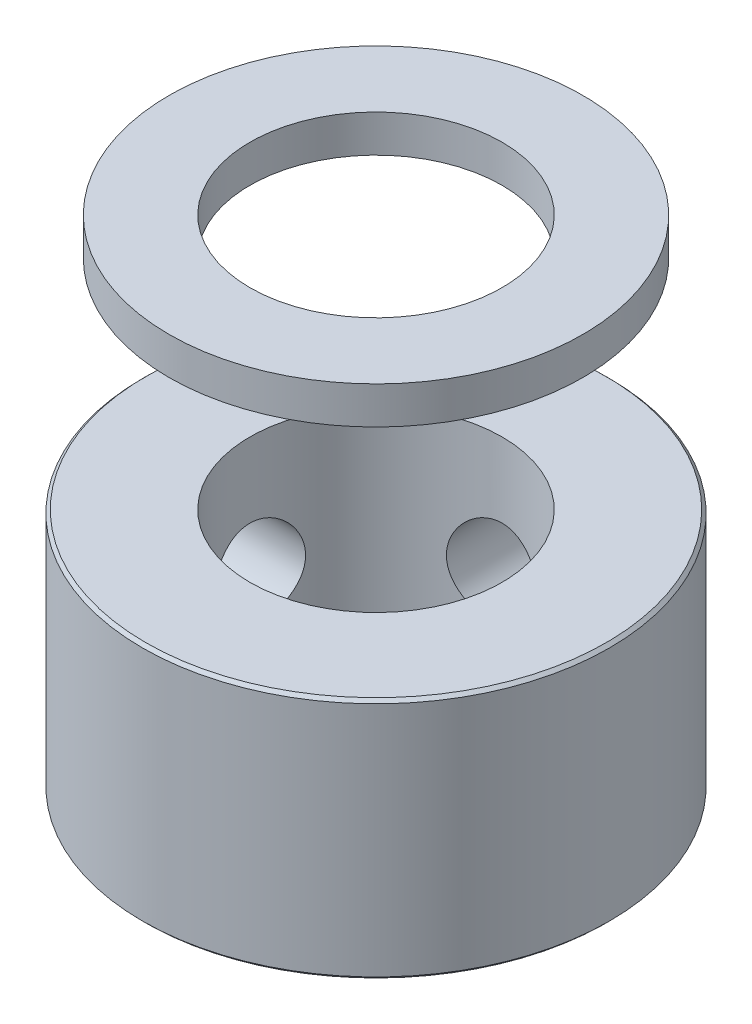
ISO-10303-21;
HEADER;
FILE_DESCRIPTION(('STEP AP214'),'2;1');
FILE_NAME('part.step','',(''),(''),'','','');
FILE_SCHEMA(('AUTOMOTIVE_DESIGN { 1 0 10303 214 1 1 1 1 }'));
ENDSEC;
DATA;
#1=APPLICATION_CONTEXT('core data for automotive mechanical design processes');
#2=APPLICATION_PROTOCOL_DEFINITION('international standard','automotive_design',2000,#1);
#3=PRODUCT_CONTEXT('',#1,'mechanical');
#4=PRODUCT('Part','Part','',(#3));
#5=PRODUCT_RELATED_PRODUCT_CATEGORY('part','',(#4));
#6=PRODUCT_DEFINITION_FORMATION('','',#4);
#7=PRODUCT_DEFINITION_CONTEXT('part definition',#1,'design');
#8=PRODUCT_DEFINITION('design','',#6,#7);
#9=PRODUCT_DEFINITION_SHAPE('','',#8);
#10=(LENGTH_UNIT() NAMED_UNIT(*) SI_UNIT(.MILLI.,.METRE.));
#11=(NAMED_UNIT(*) PLANE_ANGLE_UNIT() SI_UNIT($,.RADIAN.));
#12=(NAMED_UNIT(*) SI_UNIT($,.STERADIAN.) SOLID_ANGLE_UNIT());
#13=UNCERTAINTY_MEASURE_WITH_UNIT(LENGTH_MEASURE(1.E-05),#10,'distance_accuracy_value','');
#14=(GEOMETRIC_REPRESENTATION_CONTEXT(3) GLOBAL_UNCERTAINTY_ASSIGNED_CONTEXT((#13)) GLOBAL_UNIT_ASSIGNED_CONTEXT((#10,
#11,#12)) REPRESENTATION_CONTEXT('',''));
#15=CARTESIAN_POINT('',(0.,0.,0.));
#16=DIRECTION('',(0.,0.,1.));
#17=DIRECTION('',(1.,0.,0.));
#18=AXIS2_PLACEMENT_3D('',#15,#16,#17);
#19=CARTESIAN_POINT('',(0.,29.0132034355964,0.));
#20=DIRECTION('',(0.,-1.,0.));
#21=DIRECTION('',(0.,0.,-1.));
#22=AXIS2_PLACEMENT_3D('',#19,#20,#21);
#23=CYLINDRICAL_SURFACE('',#22,7.5);
#24=CARTESIAN_POINT('',(-7.34846922834953,3.9,1.5));
#25=CARTESIAN_POINT('',(-7.34847088538349,3.98334656323576,1.49999691881235));
#26=CARTESIAN_POINT('',(-7.34990262402618,4.06673193499975,1.49302975757707));
#27=CARTESIAN_POINT('',(-7.35546646957746,4.23114375771496,1.46536842537441));
#28=CARTESIAN_POINT('',(-7.35960073717297,4.31216826695404,1.44466327060578));
#29=CARTESIAN_POINT('',(-7.37008310582665,4.46945595503125,1.39019367392958));
#30=CARTESIAN_POINT('',(-7.37642900431582,4.54572378229886,1.35644222122892));
#31=CARTESIAN_POINT('',(-7.39061699221019,4.69151226704545,1.27687366150577));
#32=CARTESIAN_POINT('',(-7.398458998102,4.76103330080686,1.23105722790173));
#33=CARTESIAN_POINT('',(-7.4148794954137,4.89234150578079,1.12796861348015));
#34=CARTESIAN_POINT('',(-7.42346606755867,4.95401938182596,1.07055848386998));
#35=CARTESIAN_POINT('',(-7.440337084539,5.06693630036847,0.946210183531965));
#36=CARTESIAN_POINT('',(-7.44862150816248,5.11817461112579,0.879271345466975));
#37=CARTESIAN_POINT('',(-7.46404194626342,5.20918202644269,0.737042033886382));
#38=CARTESIAN_POINT('',(-7.47116732162326,5.24884727072496,0.661683851508315));
#39=CARTESIAN_POINT('',(-7.48337605325447,5.3149124055722,0.505206225580907));
#40=CARTESIAN_POINT('',(-7.48845960066179,5.34131353785148,0.424087322130829));
#41=CARTESIAN_POINT('',(-7.49595481032628,5.37976079042944,0.259525159917741));
#42=CARTESIAN_POINT('',(-7.4984007943219,5.39199146635651,0.176126608822221));
#43=CARTESIAN_POINT('',(-7.50046381775405,5.40232642775747,0.00842785265630406));
#44=CARTESIAN_POINT('',(-7.50008112979138,5.40043207446873,-0.0758722647477652));
#45=CARTESIAN_POINT('',(-7.49655652302773,5.38271072967667,-0.241713001115383));
#46=CARTESIAN_POINT('',(-7.49345397548757,5.36708253424823,-0.323275821447705));
#47=CARTESIAN_POINT('',(-7.48488265739113,5.32265245131166,-0.482597439870452));
#48=CARTESIAN_POINT('',(-7.47941379216059,5.29385003671219,-0.560356085620694));
#49=CARTESIAN_POINT('',(-7.46665944029938,5.2237049397791,-0.710429194801332));
#50=CARTESIAN_POINT('',(-7.45936272262835,5.18228437334267,-0.782706261200851));
#51=CARTESIAN_POINT('',(-7.44375704210678,5.0881363841451,-0.919357568789634));
#52=CARTESIAN_POINT('',(-7.43544796282833,5.03540766034422,-0.983730899287502));
#53=CARTESIAN_POINT('',(-7.41856446546689,4.91904956683729,-1.10392714658019));
#54=CARTESIAN_POINT('',(-7.40998794686274,4.85524621990561,-1.15958147486045));
#55=CARTESIAN_POINT('',(-7.39367357398141,4.71912533632387,-1.25942773976521));
#56=CARTESIAN_POINT('',(-7.38593573556822,4.64680763867521,-1.30361945959163));
#57=CARTESIAN_POINT('',(-7.37217071209385,4.49546875226729,-1.37934422220282));
#58=CARTESIAN_POINT('',(-7.36614722345324,4.41643354854051,-1.41084997166657));
#59=CARTESIAN_POINT('',(-7.35654714481909,4.25404301441401,-1.46008551244137));
#60=CARTESIAN_POINT('',(-7.35297023592642,4.17068824857137,-1.47781709918496));
#61=CARTESIAN_POINT('',(-7.34873218901742,4.00355271300143,-1.49874900905408));
#62=CARTESIAN_POINT('',(-7.34802220585731,3.91980363853449,-1.50219278834687));
#63=CARTESIAN_POINT('',(-7.34946728533281,3.75292766520047,-1.49510644246611));
#64=CARTESIAN_POINT('',(-7.35162218550582,3.6698007313217,-1.48457710968366));
#65=CARTESIAN_POINT('',(-7.35850848742372,3.50734703956164,-1.45005331211124));
#66=CARTESIAN_POINT('',(-7.36321498521745,3.42799148544635,-1.42618893125895));
#67=CARTESIAN_POINT('',(-7.37465234027497,3.27440508145689,-1.36581155296278));
#68=CARTESIAN_POINT('',(-7.38138336429404,3.20017465434642,-1.32929751355976));
#69=CARTESIAN_POINT('',(-7.39622108943059,3.05788033507476,-1.2441062133234));
#70=CARTESIAN_POINT('',(-7.40434457797355,2.98990943054876,-1.19527661697413));
#71=CARTESIAN_POINT('',(-7.42100585739955,2.86303753199862,-1.08704335831907));
#72=CARTESIAN_POINT('',(-7.42954369085727,2.80413747262612,-1.02763860771681));
#73=CARTESIAN_POINT('',(-7.44623018803823,2.69615616122163,-0.898848410246835));
#74=CARTESIAN_POINT('',(-7.45437086563026,2.647239518025,-0.829323748394444));
#75=CARTESIAN_POINT('',(-7.4692069144293,2.56178117775062,-0.682901844952132));
#76=CARTESIAN_POINT('',(-7.47590234632816,2.52523896098282,-0.606004913150259));
#77=CARTESIAN_POINT('',(-7.487059410916,2.46580669238005,-0.447454021236017));
#78=CARTESIAN_POINT('',(-7.49153368713906,2.44283922266062,-0.365830010217114));
#79=CARTESIAN_POINT('',(-7.4977985390649,2.41096312850423,-0.199784182019867));
#80=CARTESIAN_POINT('',(-7.49958943799765,2.40205281078647,-0.115362703066819));
#81=CARTESIAN_POINT('',(-7.50027810681181,2.39860952855567,0.0523093408554367));
#82=CARTESIAN_POINT('',(-7.49922567824026,2.40382907931568,0.135554718212255));
#83=CARTESIAN_POINT('',(-7.49445065340477,2.42795092582172,0.299956546973464));
#84=CARTESIAN_POINT('',(-7.49072809071528,2.44685304952211,0.381113024630538));
#85=CARTESIAN_POINT('',(-7.481032475475,2.49769348813747,0.538879124617646));
#86=CARTESIAN_POINT('',(-7.47506455871866,2.52960206719678,0.615498664860423));
#87=CARTESIAN_POINT('',(-7.46152083185077,2.60551836199635,0.762331830278931));
#88=CARTESIAN_POINT('',(-7.45394489468828,2.64952703385557,0.832544948651119));
#89=CARTESIAN_POINT('',(-7.43786398736791,2.74922908059312,0.965795835159537));
#90=CARTESIAN_POINT('',(-7.4293460013317,2.80509950458016,1.02869957417475));
#91=CARTESIAN_POINT('',(-7.41241834355477,2.92657536014365,1.14432392663527));
#92=CARTESIAN_POINT('',(-7.40400869794476,2.99218309420307,1.19704212480408));
#93=CARTESIAN_POINT('',(-7.3881501412478,3.13211897505031,1.29133832918279));
#94=CARTESIAN_POINT('',(-7.38071255446371,3.20653344174069,1.33279022195961));
#95=CARTESIAN_POINT('',(-7.36777855777287,3.3613991599494,1.40253607393175));
#96=CARTESIAN_POINT('',(-7.36228038807748,3.44184485804634,1.43084196896908));
#97=CARTESIAN_POINT('',(-7.3549452169166,3.58539368315525,1.4680037097813));
#98=CARTESIAN_POINT('',(-7.35253177367824,3.64767812926849,1.47998084778413));
#99=CARTESIAN_POINT('',(-7.34929317692711,3.77330093182915,1.49598002694097));
#100=CARTESIAN_POINT('',(-7.34846796865859,3.83663925186744,1.50000234234439));
#101=CARTESIAN_POINT('',(-7.34846922834953,3.9,1.5));
#102=B_SPLINE_CURVE_WITH_KNOTS('',3,(#24,#25,#26,#27,#28,#29,#30,#31,#32,#33,#34,#35,#36,#37,
#38,#39,#40,#41,#42,#43,#44,#45,#46,#47,#48,#49,#50,#51,#52,#53,#54,#55,#56,#57,#58,#59,#60,#61,
#62,#63,#64,#65,#66,#67,#68,#69,#70,#71,#72,#73,#74,#75,#76,#77,#78,#79,#80,#81,#82,#83,#84,#85,
#86,#87,#88,#89,#90,#91,#92,#93,#94,#95,#96,#97,#98,#99,#100,#101),.UNSPECIFIED.,.T.,.F.,(4,2,2,
2,2,2,2,2,2,2,2,2,2,2,2,2,2,2,2,2,2,2,2,2,2,2,2,2,2,2,2,2,2,2,2,2,2,2,4),(0.,0.249807695804143,
0.499815358926445,0.749574746910879,0.999320197289796,1.25223378822655,1.50516510053133,
1.76030100656175,2.0154130236984,2.26716373324621,2.51889018174372,2.76703184450306,
3.01518343610626,3.26489886333455,3.51464303655099,3.76874020143725,4.02284217184081,
4.27748794759165,4.53210052524037,4.7823563670689,5.03259801792632,5.28044012674978,
5.52830265531598,5.77939589661782,6.03051499305313,6.28548902600176,6.54045234945157,
6.79394720367975,7.04741152037442,7.29646526122029,7.54551587050135,7.79400025613178,
8.04250428202027,8.29501728038395,8.54759008334672,8.80288347868562,9.05794462633399,
9.24785705455344,9.43776293526322),.UNSPECIFIED.);
#103=CARTESIAN_POINT('',(-7.34846922834953,3.9,1.5));
#104=VERTEX_POINT('',#103);
#105=EDGE_CURVE('E89',#104,#104,#102,.T.);
#106=ORIENTED_EDGE('',*,*,#105,.F.);
#107=EDGE_LOOP('',(#106));
#108=FACE_BOUND('',#107,.T.);
#109=CARTESIAN_POINT('',(0.,5.4,-7.5));
#110=CARTESIAN_POINT('',(0.0833653601889499,5.39999693325248,-7.49999846371307));
#111=CARTESIAN_POINT('',(0.166769490302284,5.39302673554853,-7.49859577767346));
#112=CARTESIAN_POINT('',(0.331220261533529,5.36535224982713,-7.49313548434847));
#113=CARTESIAN_POINT('',(0.412264976312034,5.34463705079773,-7.48907576790279));
#114=CARTESIAN_POINT('',(0.569595457894969,5.29013808956882,-7.4787547391743));
#115=CARTESIAN_POINT('',(0.645885701899702,5.25636684473297,-7.47249553615077));
#116=CARTESIAN_POINT('',(0.791711983296339,5.17675162873306,-7.45845597052971));
#117=CARTESIAN_POINT('',(0.861248422613718,5.13090837658919,-7.4506756985356));
#118=CARTESIAN_POINT('',(0.992540215972298,5.02779225856285,-7.43433247994955));
#119=CARTESIAN_POINT('',(1.05419092673779,4.97038746691319,-7.42576118256521));
#120=CARTESIAN_POINT('',(1.16705513491204,4.84606137541245,-7.40886270678882));
#121=CARTESIAN_POINT('',(1.21826781715564,4.77913933299732,-7.40053554750636));
#122=CARTESIAN_POINT('',(1.30924763002143,4.63692571048219,-7.38498662718923));
#123=CARTESIAN_POINT('',(1.3489064082988,4.56156353430546,-7.37777561047419));
#124=CARTESIAN_POINT('',(1.41495849987046,4.40507727149388,-7.36539402087627));
#125=CARTESIAN_POINT('',(1.44135312365586,4.32395375498048,-7.36022324642942));
#126=CARTESIAN_POINT('',(1.47978794982724,4.15937345413812,-7.35259207878307));
#127=CARTESIAN_POINT('',(1.49201174693817,4.07596118378666,-7.35009705160781));
#128=CARTESIAN_POINT('',(1.50232819158918,3.90823526795349,-7.34799562590941));
#129=CARTESIAN_POINT('',(1.50042228407025,3.82392171551978,-7.34838893201761));
#130=CARTESIAN_POINT('',(1.48268185965273,3.65812981796849,-7.35198826722277));
#131=CARTESIAN_POINT('',(1.46705781036586,3.57662789155903,-7.35515179288145));
#132=CARTESIAN_POINT('',(1.42265682693458,3.4174258850055,-7.36386819240002));
#133=CARTESIAN_POINT('',(1.39387926465102,3.33972598662149,-7.36942118036668));
#134=CARTESIAN_POINT('',(1.32378717551208,3.1897271074446,-7.38233427750612));
#135=CARTESIAN_POINT('',(1.28238922684817,3.11746818064624,-7.38970634720557));
#136=CARTESIAN_POINT('',(1.18829036185902,2.98084372504078,-7.40541928159593));
#137=CARTESIAN_POINT('',(1.13558814653524,2.91647910472326,-7.41376025757549));
#138=CARTESIAN_POINT('',(1.01924990184088,2.79625589631459,-7.43065531862193));
#139=CARTESIAN_POINT('',(0.955434241818667,2.7405711482113,-7.43921053816357));
#140=CARTESIAN_POINT('',(0.819277536093014,2.64066923054816,-7.45543273071613));
#141=CARTESIAN_POINT('',(0.746936381069083,2.59645220805963,-7.4630996923346));
#142=CARTESIAN_POINT('',(0.595589080318381,2.52070873616104,-7.47670035241331));
#143=CARTESIAN_POINT('',(0.51657272937795,2.48920215953319,-7.48263133272408));
#144=CARTESIAN_POINT('',(0.354223464672997,2.43995928894215,-7.49207113481787));
#145=CARTESIAN_POINT('',(0.270891075108674,2.42222132688956,-7.49558025000797));
#146=CARTESIAN_POINT('',(0.103769108440726,2.40126531930858,-7.49974007800302));
#147=CARTESIAN_POINT('',(0.0200104924883643,2.3978093706896,-7.50043761978705));
#148=CARTESIAN_POINT('',(-0.146887401289071,2.40487478841327,-7.49902577895154));
#149=CARTESIAN_POINT('',(-0.23002671366569,2.41539536902889,-7.49691655412169));
#150=CARTESIAN_POINT('',(-0.392558489919811,2.44991756031593,-7.49015748012026));
#151=CARTESIAN_POINT('',(-0.471977922509855,2.47379710274685,-7.4855306460631));
#152=CARTESIAN_POINT('',(-0.625685441249501,2.53422597398371,-7.47425328091549));
#153=CARTESIAN_POINT('',(-0.699973142456309,2.57077625201524,-7.4676025982134));
#154=CARTESIAN_POINT('',(-0.842311760529326,2.65602373597697,-7.45289867299942));
#155=CARTESIAN_POINT('',(-0.910275190128282,2.70486417155842,-7.44482925655578));
#156=CARTESIAN_POINT('',(-1.03712702867881,2.81311378681092,-7.42822102244824));
#157=CARTESIAN_POINT('',(-1.09601446339614,2.8725240995998,-7.41968215452582));
#158=CARTESIAN_POINT('',(-1.20396088616126,3.00131002783668,-7.40293955335447));
#159=CARTESIAN_POINT('',(-1.25285655367298,3.070823616332,-7.39474290349956));
#160=CARTESIAN_POINT('',(-1.33827813007681,3.21721704203502,-7.37976287694291));
#161=CARTESIAN_POINT('',(-1.37480453388435,3.29409658436033,-7.37297944370014));
#162=CARTESIAN_POINT('',(-1.43422776237294,3.45265236922432,-7.36165110876574));
#163=CARTESIAN_POINT('',(-1.45719524968658,3.53430126181548,-7.3570946230828));
#164=CARTESIAN_POINT('',(-1.48906297744079,3.70040018023636,-7.35071155188038));
#165=CARTESIAN_POINT('',(-1.49796505233767,3.78484983931402,-7.34888461036667));
#166=CARTESIAN_POINT('',(-1.5013813663012,3.95251329681648,-7.34818724447069));
#167=CARTESIAN_POINT('',(-1.49615368210634,4.03572172339051,-7.34926378783951));
#168=CARTESIAN_POINT('',(-1.47202845615009,4.20004747485754,-7.35413360226921));
#169=CARTESIAN_POINT('',(-1.45313102419395,4.28116481654221,-7.35792685150754));
#170=CARTESIAN_POINT('',(-1.40231785274843,4.43884156686082,-7.36777896328738));
#171=CARTESIAN_POINT('',(-1.37043376007602,4.51541154075362,-7.37383231528246));
#172=CARTESIAN_POINT('',(-1.29458196690241,4.66215558110166,-7.38752572461255));
#173=CARTESIAN_POINT('',(-1.25061325316232,4.73232911058771,-7.39516591498341));
#174=CARTESIAN_POINT('',(-1.15095887217962,4.86557335822547,-7.41133440784838));
#175=CARTESIAN_POINT('',(-1.09508683085277,4.92850314790139,-7.41987559364549));
#176=CARTESIAN_POINT('',(-0.973596553519711,5.04417930829376,-7.43679122807932));
#177=CARTESIAN_POINT('',(-0.907976080730002,5.09692333547591,-7.44516563794777));
#178=CARTESIAN_POINT('',(-0.768026443632369,5.19125196591967,-7.46090748581957));
#179=CARTESIAN_POINT('',(-0.693613326644751,5.23271400492004,-7.46826346828869));
#180=CARTESIAN_POINT('',(-0.538749541411098,5.30247918389489,-7.481026876275));
#181=CARTESIAN_POINT('',(-0.458304391294689,5.33079418429874,-7.48643605707924));
#182=CARTESIAN_POINT('',(-0.314732233385669,5.36797792206707,-7.49364558893056));
#183=CARTESIAN_POINT('',(-0.252422496020677,5.37996479056164,-7.49601454737677));
#184=CARTESIAN_POINT('',(-0.1267492878151,5.39597686853755,-7.49919231209839));
#185=CARTESIAN_POINT('',(-0.0633858506229285,5.40000233176465,-7.50000116809732));
#186=CARTESIAN_POINT('',(0.,5.4,-7.5));
#187=B_SPLINE_CURVE_WITH_KNOTS('',3,(#109,#110,#111,#112,#113,#114,#115,#116,#117,#118,#119,
#120,#121,#122,#123,#124,#125,#126,#127,#128,#129,#130,#131,#132,#133,#134,#135,#136,#137,#138,
#139,#140,#141,#142,#143,#144,#145,#146,#147,#148,#149,#150,#151,#152,#153,#154,#155,#156,#157,
#158,#159,#160,#161,#162,#163,#164,#165,#166,#167,#168,#169,#170,#171,#172,#173,#174,#175,#176,
#177,#178,#179,#180,#181,#182,#183,#184,#185,#186),.UNSPECIFIED.,.T.,.F.,(4,2,2,2,2,2,2,2,2,2,2,
2,2,2,2,2,2,2,2,2,2,2,2,2,2,2,2,2,2,2,2,2,2,2,2,2,2,2,4),(0.,0.249864195991888,
0.499926976036985,0.749750602875513,0.999559353346295,1.25239900516828,1.50525839512105,
1.76041792508884,2.01555224047796,2.26734277655381,2.51910756421838,2.76707590509417,
3.01505608880595,3.26471235305389,3.51439732124506,3.76857378737026,4.0227535130973,
4.27732912281036,4.53187388547054,4.78216103514398,5.03243411486801,5.28045680926085,
5.52849808824034,5.77957599050038,6.03068082518895,6.28560942868839,6.540527830852,
6.79410571549085,7.04765052495622,7.29659583851552,7.54553915238913,7.79387941879665,
8.042240513728,8.29482114358714,8.54745981799396,8.80274245013456,9.05779433276278,
9.24778162934841,9.43776287056494),.UNSPECIFIED.);
#188=CARTESIAN_POINT('',(0.,5.4,-7.5));
#189=VERTEX_POINT('',#188);
#190=EDGE_CURVE('E81',#189,#189,#187,.T.);
#191=ORIENTED_EDGE('',*,*,#190,.F.);
#192=EDGE_LOOP('',(#191));
#193=FACE_BOUND('',#192,.T.);
#194=CARTESIAN_POINT('',(0.,0.0999999999999959,0.));
#195=DIRECTION('',(0.,-1.,0.));
#196=DIRECTION('',(0.,0.,-1.));
#197=AXIS2_PLACEMENT_3D('',#194,#195,#196);
#198=CIRCLE('',#197,7.5);
#199=CARTESIAN_POINT('',(0.,0.0999999999999959,-7.5));
#200=VERTEX_POINT('',#199);
#201=EDGE_CURVE('E69',#200,#200,#198,.F.);
#202=ORIENTED_EDGE('',*,*,#201,.T.);
#203=EDGE_LOOP('',(#202));
#204=FACE_BOUND('',#203,.T.);
#205=CARTESIAN_POINT('',(0.,7.7,0.));
#206=DIRECTION('',(0.,1.,0.));
#207=DIRECTION('',(0.,0.,1.));
#208=AXIS2_PLACEMENT_3D('',#205,#206,#207);
#209=CIRCLE('',#208,7.5);
#210=CARTESIAN_POINT('',(0.,7.7,7.5));
#211=VERTEX_POINT('',#210);
#212=EDGE_CURVE('E73',#211,#211,#209,.F.);
#213=ORIENTED_EDGE('',*,*,#212,.T.);
#214=EDGE_LOOP('',(#213));
#215=FACE_BOUND('',#214,.T.);
#216=ADVANCED_FACE('F56',(#108,#193,#204,#215),#23,.T.);
#217=CARTESIAN_POINT('',(0.,0.,0.));
#218=DIRECTION('',(0.,-1.,0.));
#219=DIRECTION('',(0.,0.,-1.));
#220=AXIS2_PLACEMENT_3D('',#217,#218,#219);
#221=PLANE('',#220);
#222=CARTESIAN_POINT('',(0.,0.,0.));
#223=DIRECTION('',(0.,-1.,0.));
#224=DIRECTION('',(0.,0.,-1.));
#225=AXIS2_PLACEMENT_3D('',#222,#223,#224);
#226=CIRCLE('',#225,4.05);
#227=CARTESIAN_POINT('',(0.,0.,-4.05));
#228=VERTEX_POINT('',#227);
#229=EDGE_CURVE('E113',#228,#228,#226,.T.);
#230=ORIENTED_EDGE('',*,*,#229,.F.);
#231=EDGE_LOOP('',(#230));
#232=FACE_BOUND('',#231,.T.);
#233=CARTESIAN_POINT('',(0.,0.,0.));
#234=DIRECTION('',(0.,-1.,0.));
#235=DIRECTION('',(0.,0.,-1.));
#236=AXIS2_PLACEMENT_3D('',#233,#234,#235);
#237=CIRCLE('',#236,7.4);
#238=CARTESIAN_POINT('',(0.,0.,-7.4));
#239=VERTEX_POINT('',#238);
#240=EDGE_CURVE('E78',#239,#239,#237,.T.);
#241=ORIENTED_EDGE('',*,*,#240,.T.);
#242=EDGE_LOOP('',(#241));
#243=FACE_BOUND('',#242,.T.);
#244=ADVANCED_FACE('F103',(#232,#243),#221,.T.);
#245=CARTESIAN_POINT('',(-5.82920154766281,7.8,-0.651228844027839));
#246=DIRECTION('',(0.,1.,0.));
#247=DIRECTION('',(0.,0.,1.));
#248=AXIS2_PLACEMENT_3D('',#245,#246,#247);
#249=PLANE('',#248);
#250=CARTESIAN_POINT('',(0.,7.8,0.));
#251=DIRECTION('',(0.,1.,0.));
#252=DIRECTION('',(0.,0.,1.));
#253=AXIS2_PLACEMENT_3D('',#250,#251,#252);
#254=CIRCLE('',#253,4.05);
#255=CARTESIAN_POINT('',(0.,7.8,4.05));
#256=VERTEX_POINT('',#255);
#257=EDGE_CURVE('E112',#256,#256,#254,.T.);
#258=ORIENTED_EDGE('',*,*,#257,.F.);
#259=EDGE_LOOP('',(#258));
#260=FACE_BOUND('',#259,.T.);
#261=CARTESIAN_POINT('',(0.,7.8,0.));
#262=DIRECTION('',(0.,1.,0.));
#263=DIRECTION('',(0.,0.,1.));
#264=AXIS2_PLACEMENT_3D('',#261,#262,#263);
#265=CIRCLE('',#264,7.4);
#266=CARTESIAN_POINT('',(0.,7.8,7.4));
#267=VERTEX_POINT('',#266);
#268=EDGE_CURVE('E13',#267,#267,#265,.T.);
#269=ORIENTED_EDGE('',*,*,#268,.T.);
#270=EDGE_LOOP('',(#269));
#271=FACE_BOUND('',#270,.T.);
#272=ADVANCED_FACE('F130',(#260,#271),#249,.T.);
#273=CARTESIAN_POINT('',(0.,0.,0.));
#274=DIRECTION('',(0.,1.,0.));
#275=DIRECTION('',(0.,0.,1.));
#276=AXIS2_PLACEMENT_3D('',#273,#274,#275);
#277=CONICAL_SURFACE('',#276,7.4,0.785398163397444);
#278=ORIENTED_EDGE('',*,*,#201,.F.);
#279=EDGE_LOOP('',(#278));
#280=FACE_BOUND('',#279,.T.);
#281=ORIENTED_EDGE('',*,*,#240,.F.);
#282=EDGE_LOOP('',(#281));
#283=FACE_BOUND('',#282,.T.);
#284=ADVANCED_FACE('F142',(#280,#283),#277,.T.);
#285=CARTESIAN_POINT('',(0.,7.7,0.));
#286=DIRECTION('',(0.,-1.,0.));
#287=DIRECTION('',(0.,0.,-1.));
#288=AXIS2_PLACEMENT_3D('',#285,#286,#287);
#289=CONICAL_SURFACE('',#288,7.5,0.78539816339747);
#290=ORIENTED_EDGE('',*,*,#268,.F.);
#291=EDGE_LOOP('',(#290));
#292=FACE_BOUND('',#291,.T.);
#293=ORIENTED_EDGE('',*,*,#212,.F.);
#294=EDGE_LOOP('',(#293));
#295=FACE_BOUND('',#294,.T.);
#296=ADVANCED_FACE('F58',(#292,#295),#289,.T.);
#297=CARTESIAN_POINT('',(0.,3.9,-2.5));
#298=DIRECTION('',(0.,0.,-1.));
#299=DIRECTION('',(-1.,0.,0.));
#300=AXIS2_PLACEMENT_3D('',#297,#298,#299);
#301=CYLINDRICAL_SURFACE('',#300,1.5);
#302=CARTESIAN_POINT('',(-1.5,3.9,-3.76198086119534));
#303=CARTESIAN_POINT('',(-1.50000268526301,3.81891086653167,-3.76197839280445));
#304=CARTESIAN_POINT('',(-1.49340264076728,3.73783969095228,-3.76463115394949));
#305=CARTESIAN_POINT('',(-1.46729342623131,3.57813675696255,-3.77488334160202));
#306=CARTESIAN_POINT('',(-1.44778438739025,3.49950497376821,-3.78248271783512));
#307=CARTESIAN_POINT('',(-1.39666712891509,3.34702998485343,-3.80165174920774));
#308=CARTESIAN_POINT('',(-1.36508726383579,3.27317602775594,-3.81321209342976));
#309=CARTESIAN_POINT('',(-1.2908248804427,3.13178609309349,-3.83898567457824));
#310=CARTESIAN_POINT('',(-1.24813911665265,3.06425197023043,-3.85319968664243));
#311=CARTESIAN_POINT('',(-1.15066109488168,2.93414602378057,-3.88345087211371));
#312=CARTESIAN_POINT('',(-1.09541831087432,2.87192391460834,-3.89954077914951));
#313=CARTESIAN_POINT('',(-0.975350935608381,2.75738155863417,-3.93129025761673));
#314=CARTESIAN_POINT('',(-0.910524369137047,2.70506335810389,-3.94694973954686));
#315=CARTESIAN_POINT('',(-0.770486414268711,2.61014086287826,-3.97669889097027));
#316=CARTESIAN_POINT('',(-0.695002454882204,2.56791511186464,-3.99071950369741));
#317=CARTESIAN_POINT('',(-0.53739163469184,2.49690576921902,-4.01497876804958));
#318=CARTESIAN_POINT('',(-0.45526702795573,2.46811763867368,-4.02521869645653));
#319=CARTESIAN_POINT('',(-0.290381657868036,2.42602250863372,-4.04038858558274));
#320=CARTESIAN_POINT('',(-0.207793810305046,2.41211378439031,-4.04552428501195));
#321=CARTESIAN_POINT('',(-0.0413072394312783,2.39824599139475,-4.05064448004876));
#322=CARTESIAN_POINT('',(0.0425910595962084,2.39828249753571,-4.05063060972022));
#323=CARTESIAN_POINT('',(0.205010295749702,2.41195006131238,-4.0455850984626));
#324=CARTESIAN_POINT('',(0.283595294198198,2.42492471753857,-4.04079573726147));
#325=CARTESIAN_POINT('',(0.437381552327644,2.46299829394546,-4.02705356647878));
#326=CARTESIAN_POINT('',(0.512582572712142,2.48809807008024,-4.01810046296595));
#327=CARTESIAN_POINT('',(0.658752801329339,2.55002307690829,-3.99675915596456));
#328=CARTESIAN_POINT('',(0.729645307556595,2.58701224210416,-3.98432325904462));
#329=CARTESIAN_POINT('',(0.864391370654589,2.67152222174946,-3.95727903982467));
#330=CARTESIAN_POINT('',(0.928242678334625,2.7190463869161,-3.94267002684004));
#331=CARTESIAN_POINT('',(1.05096585592654,2.8264572117511,-3.91180298180388));
#332=CARTESIAN_POINT('',(1.10934390094551,2.88689556525953,-3.8954984243782));
#333=CARTESIAN_POINT('',(1.21531903186268,3.01680745123776,-3.86375039575867));
#334=CARTESIAN_POINT('',(1.26291354531248,3.08628313338422,-3.84830713069002));
#335=CARTESIAN_POINT('',(1.34688236495765,3.2342006228061,-3.81974128332706));
#336=CARTESIAN_POINT('',(1.38299759688043,3.31280120263355,-3.80667479874832));
#337=CARTESIAN_POINT('',(1.44129459222816,3.47557948136236,-3.78498994926376));
#338=CARTESIAN_POINT('',(1.46348388054182,3.55975414107555,-3.77636918256249));
#339=CARTESIAN_POINT('',(1.49218967151314,3.72642115899883,-3.7651157106558));
#340=CARTESIAN_POINT('',(1.49948858623343,3.80875846945688,-3.7621844890466));
#341=CARTESIAN_POINT('',(1.50045904541502,3.97351558405182,-3.76179811369397));
#342=CARTESIAN_POINT('',(1.49413387646042,4.05593536350027,-3.76434163925854));
#343=CARTESIAN_POINT('',(1.46874447698623,4.21455961016314,-3.77431560937444));
#344=CARTESIAN_POINT('',(1.45027764868389,4.29087578277982,-3.78151663420189));
#345=CARTESIAN_POINT('',(1.40187668611806,4.43929390696458,-3.79972440246217));
#346=CARTESIAN_POINT('',(1.37194023753252,4.51139500463505,-3.81073191391822));
#347=CARTESIAN_POINT('',(1.3002061083661,4.65229198213217,-3.83581210076335));
#348=CARTESIAN_POINT('',(1.25801174060833,4.72086793180903,-3.84998283895795));
#349=CARTESIAN_POINT('',(1.16338463506486,4.85024459848432,-3.87962514523604));
#350=CARTESIAN_POINT('',(1.11094823035484,4.9110425177984,-3.89509717808496));
#351=CARTESIAN_POINT('',(0.993504126214828,5.02701834020833,-3.92674995855116));
#352=CARTESIAN_POINT('',(0.927921237045249,5.08161983983996,-3.94291569826283));
#353=CARTESIAN_POINT('',(0.788126344879295,5.17910783640429,-3.97321850327075));
#354=CARTESIAN_POINT('',(0.713914363104408,5.2219943621467,-3.98735557355591));
#355=CARTESIAN_POINT('',(0.559061204061839,5.29453528925228,-4.01199023462045));
#356=CARTESIAN_POINT('',(0.478446519637073,5.32424117740281,-4.02250195040793));
#357=CARTESIAN_POINT('',(0.31288762217606,5.36950903351663,-4.03875045169103));
#358=CARTESIAN_POINT('',(0.227945406398301,5.38507746490672,-4.04448941911234));
#359=CARTESIAN_POINT('',(0.0613592363511148,5.40094439553546,-4.05034387403351));
#360=CARTESIAN_POINT('',(-0.020196734863075,5.40206271323805,-4.05076125919962));
#361=CARTESIAN_POINT('',(-0.182283854179243,5.3910964224398,-4.04670758061015));
#362=CARTESIAN_POINT('',(-0.262815119710378,5.37901334083151,-4.04223708219408));
#363=CARTESIAN_POINT('',(-0.418662569759399,5.34256012810747,-4.02904479703217));
#364=CARTESIAN_POINT('',(-0.494056586231361,5.31848319870074,-4.02042461503456));
#365=CARTESIAN_POINT('',(-0.639743886165475,5.25901504434104,-3.99983077313999));
#366=CARTESIAN_POINT('',(-0.710036202324679,5.22362168058717,-3.9878564793705));
#367=CARTESIAN_POINT('',(-0.846722267802311,5.14084974508666,-3.96113788233216));
#368=CARTESIAN_POINT('',(-0.912832653753186,5.09303426784743,-3.94629915304809));
#369=CARTESIAN_POINT('',(-1.0363464513832,4.9874702419681,-3.91567902176774));
#370=CARTESIAN_POINT('',(-1.09374677360271,4.92971818424989,-3.89989728804132));
#371=CARTESIAN_POINT('',(-1.2012302147107,4.80240437394685,-3.86818412587118));
#372=CARTESIAN_POINT('',(-1.25078861265519,4.73238953348598,-3.85228636044178));
#373=CARTESIAN_POINT('',(-1.33744992968852,4.58452221339597,-3.82306517871813));
#374=CARTESIAN_POINT('',(-1.37455213911701,4.50666928753978,-3.80974190911773));
#375=CARTESIAN_POINT('',(-1.43601670526684,4.34247825652102,-3.78701428709424));
#376=CARTESIAN_POINT('',(-1.4599134543382,4.25594387570858,-3.77775528078647));
#377=CARTESIAN_POINT('',(-1.49189875430892,4.07959762401924,-3.76524178067321));
#378=CARTESIAN_POINT('',(-1.49999702668092,3.98978780334453,-3.76198359437777));
#379=CARTESIAN_POINT('',(-1.5,3.9,-3.76198086119534));
#380=B_SPLINE_CURVE_WITH_KNOTS('',3,(#302,#303,#304,#305,#306,#307,#308,#309,#310,#311,#312,
#313,#314,#315,#316,#317,#318,#319,#320,#321,#322,#323,#324,#325,#326,#327,#328,#329,#330,#331,
#332,#333,#334,#335,#336,#337,#338,#339,#340,#341,#342,#343,#344,#345,#346,#347,#348,#349,#350,
#351,#352,#353,#354,#355,#356,#357,#358,#359,#360,#361,#362,#363,#364,#365,#366,#367,#368,#369,
#370,#371,#372,#373,#374,#375,#376,#377,#378,#379),.UNSPECIFIED.,.T.,.F.,(4,2,2,2,2,2,2,2,2,2,2,
2,2,2,2,2,2,2,2,2,2,2,2,2,2,2,2,2,2,2,2,2,2,2,2,2,2,2,4),(0.,0.242933264780759,
0.485864060573542,0.728227680714842,0.97066220647273,1.22377778926956,1.47694561197519,
1.73848739194063,1.99994076517857,2.25036705443976,2.50071387838223,2.7389744847736,
2.97725191326209,3.21896687480589,3.46075882576671,3.71638304363279,3.97206817747706,
4.23317026287089,4.49413113990897,4.74098468620362,4.98777868984588,5.22325683021158,
5.45878251003316,5.70299346281828,5.94729201048285,6.20663019986449,6.4659677514704,
6.72428315168351,6.98248039454193,7.22596012354543,7.46941169431967,7.70718414319922,
7.94500155755302,8.19270089795977,8.44048789297793,8.70095423176161,8.9614354074497,
9.23059451546758,9.49958794616565),.UNSPECIFIED.);
#381=CARTESIAN_POINT('',(-1.5,3.9,-3.76198086119534));
#382=VERTEX_POINT('',#381);
#383=EDGE_CURVE('E106',#382,#382,#380,.T.);
#384=ORIENTED_EDGE('',*,*,#383,.T.);
#385=EDGE_LOOP('',(#384));
#386=FACE_BOUND('',#385,.T.);
#387=ORIENTED_EDGE('',*,*,#190,.T.);
#388=EDGE_LOOP('',(#387));
#389=FACE_BOUND('',#388,.T.);
#390=ADVANCED_FACE('F97',(#386,#389),#301,.F.);
#391=CARTESIAN_POINT('',(-2.5,3.9,0.));
#392=DIRECTION('',(-1.,0.,0.));
#393=DIRECTION('',(0.,0.,1.));
#394=AXIS2_PLACEMENT_3D('',#391,#392,#393);
#395=CYLINDRICAL_SURFACE('',#394,1.5);
#396=CARTESIAN_POINT('',(-3.76198086119534,3.9,1.5));
#397=CARTESIAN_POINT('',(-3.76197839280445,3.81891086653167,1.50000268526301));
#398=CARTESIAN_POINT('',(-3.76463115394949,3.73783969095228,1.49340264076728));
#399=CARTESIAN_POINT('',(-3.77488334160202,3.57813675696255,1.46729342623131));
#400=CARTESIAN_POINT('',(-3.78248271783512,3.49950497376821,1.44778438739025));
#401=CARTESIAN_POINT('',(-3.80165174920774,3.34702998485343,1.39666712891509));
#402=CARTESIAN_POINT('',(-3.81321209342976,3.27317602775594,1.36508726383579));
#403=CARTESIAN_POINT('',(-3.83898567457824,3.13178609309349,1.2908248804427));
#404=CARTESIAN_POINT('',(-3.85319968664243,3.06425197023043,1.24813911665265));
#405=CARTESIAN_POINT('',(-3.88345087211371,2.93414602378057,1.15066109488168));
#406=CARTESIAN_POINT('',(-3.89954077914951,2.87192391460834,1.09541831087432));
#407=CARTESIAN_POINT('',(-3.93129025761673,2.75738155863417,0.975350935608381));
#408=CARTESIAN_POINT('',(-3.94694973954686,2.70506335810389,0.910524369137047));
#409=CARTESIAN_POINT('',(-3.97669889097027,2.61014086287826,0.770486414268711));
#410=CARTESIAN_POINT('',(-3.99071950369741,2.56791511186464,0.695002454882204));
#411=CARTESIAN_POINT('',(-4.01497876804958,2.49690576921902,0.53739163469184));
#412=CARTESIAN_POINT('',(-4.02521869645653,2.46811763867368,0.45526702795573));
#413=CARTESIAN_POINT('',(-4.04038858558274,2.42602250863372,0.290381657868036));
#414=CARTESIAN_POINT('',(-4.04552428501195,2.41211378439031,0.207793810305046));
#415=CARTESIAN_POINT('',(-4.05064448004876,2.39824599139475,0.0413072394312782));
#416=CARTESIAN_POINT('',(-4.05063060972022,2.39828249753571,-0.0425910595962086));
#417=CARTESIAN_POINT('',(-4.0455850984626,2.41195006131238,-0.205010295749702));
#418=CARTESIAN_POINT('',(-4.04079573726147,2.42492471753857,-0.283595294198198));
#419=CARTESIAN_POINT('',(-4.02705356647878,2.46299829394546,-0.437381552327644));
#420=CARTESIAN_POINT('',(-4.01810046296595,2.48809807008024,-0.512582572712142));
#421=CARTESIAN_POINT('',(-3.99675915596456,2.55002307690829,-0.658752801329339));
#422=CARTESIAN_POINT('',(-3.98432325904462,2.58701224210416,-0.729645307556595));
#423=CARTESIAN_POINT('',(-3.95727903982467,2.67152222174946,-0.864391370654589));
#424=CARTESIAN_POINT('',(-3.94267002684004,2.7190463869161,-0.928242678334625));
#425=CARTESIAN_POINT('',(-3.91180298180388,2.8264572117511,-1.05096585592654));
#426=CARTESIAN_POINT('',(-3.8954984243782,2.88689556525953,-1.10934390094551));
#427=CARTESIAN_POINT('',(-3.86375039575867,3.01680745123776,-1.21531903186268));
#428=CARTESIAN_POINT('',(-3.84830713069002,3.08628313338422,-1.26291354531248));
#429=CARTESIAN_POINT('',(-3.81974128332706,3.2342006228061,-1.34688236495765));
#430=CARTESIAN_POINT('',(-3.80667479874832,3.31280120263355,-1.38299759688043));
#431=CARTESIAN_POINT('',(-3.78498994926376,3.47557948136236,-1.44129459222816));
#432=CARTESIAN_POINT('',(-3.77636918256249,3.55975414107555,-1.46348388054182));
#433=CARTESIAN_POINT('',(-3.7651157106558,3.72642115899883,-1.49218967151314));
#434=CARTESIAN_POINT('',(-3.7621844890466,3.80875846945688,-1.49948858623343));
#435=CARTESIAN_POINT('',(-3.76179811369397,3.97351558405182,-1.50045904541502));
#436=CARTESIAN_POINT('',(-3.76434163925854,4.05593536350027,-1.49413387646042));
#437=CARTESIAN_POINT('',(-3.77431560937444,4.21455961016314,-1.46874447698623));
#438=CARTESIAN_POINT('',(-3.78151663420189,4.29087578277982,-1.45027764868389));
#439=CARTESIAN_POINT('',(-3.79972440246217,4.43929390696458,-1.40187668611806));
#440=CARTESIAN_POINT('',(-3.81073191391822,4.51139500463505,-1.37194023753252));
#441=CARTESIAN_POINT('',(-3.83581210076335,4.65229198213217,-1.3002061083661));
#442=CARTESIAN_POINT('',(-3.84998283895795,4.72086793180903,-1.25801174060833));
#443=CARTESIAN_POINT('',(-3.87962514523604,4.85024459848432,-1.16338463506486));
#444=CARTESIAN_POINT('',(-3.89509717808496,4.9110425177984,-1.11094823035484));
#445=CARTESIAN_POINT('',(-3.92674995855116,5.02701834020833,-0.993504126214828));
#446=CARTESIAN_POINT('',(-3.94291569826283,5.08161983983996,-0.927921237045249));
#447=CARTESIAN_POINT('',(-3.97321850327075,5.17910783640429,-0.788126344879295));
#448=CARTESIAN_POINT('',(-3.98735557355591,5.2219943621467,-0.713914363104409));
#449=CARTESIAN_POINT('',(-4.01199023462045,5.29453528925228,-0.559061204061839));
#450=CARTESIAN_POINT('',(-4.02250195040793,5.32424117740281,-0.478446519637073));
#451=CARTESIAN_POINT('',(-4.03875045169103,5.36950903351663,-0.31288762217606));
#452=CARTESIAN_POINT('',(-4.04448941911234,5.38507746490672,-0.227945406398301));
#453=CARTESIAN_POINT('',(-4.05034387403351,5.40094439553546,-0.0613592363511149));
#454=CARTESIAN_POINT('',(-4.05076125919962,5.40206271323805,0.0201967348630749));
#455=CARTESIAN_POINT('',(-4.04670758061015,5.3910964224398,0.182283854179243));
#456=CARTESIAN_POINT('',(-4.04223708219408,5.37901334083151,0.262815119710378));
#457=CARTESIAN_POINT('',(-4.02904479703217,5.34256012810747,0.418662569759398));
#458=CARTESIAN_POINT('',(-4.02042461503456,5.31848319870074,0.494056586231361));
#459=CARTESIAN_POINT('',(-3.99983077313999,5.25901504434104,0.639743886165475));
#460=CARTESIAN_POINT('',(-3.9878564793705,5.22362168058717,0.710036202324678));
#461=CARTESIAN_POINT('',(-3.96113788233216,5.14084974508666,0.846722267802311));
#462=CARTESIAN_POINT('',(-3.94629915304809,5.09303426784743,0.912832653753186));
#463=CARTESIAN_POINT('',(-3.91567902176774,4.9874702419681,1.0363464513832));
#464=CARTESIAN_POINT('',(-3.89989728804132,4.92971818424989,1.09374677360271));
#465=CARTESIAN_POINT('',(-3.86818412587118,4.80240437394685,1.2012302147107));
#466=CARTESIAN_POINT('',(-3.85228636044178,4.73238953348598,1.25078861265519));
#467=CARTESIAN_POINT('',(-3.82306517871813,4.58452221339597,1.33744992968852));
#468=CARTESIAN_POINT('',(-3.80974190911773,4.50666928753978,1.37455213911701));
#469=CARTESIAN_POINT('',(-3.78701428709424,4.34247825652102,1.43601670526684));
#470=CARTESIAN_POINT('',(-3.77775528078647,4.25594387570858,1.4599134543382));
#471=CARTESIAN_POINT('',(-3.76524178067321,4.07959762401924,1.49189875430892));
#472=CARTESIAN_POINT('',(-3.76198359437777,3.98978780334453,1.49999702668092));
#473=CARTESIAN_POINT('',(-3.76198086119534,3.9,1.5));
#474=B_SPLINE_CURVE_WITH_KNOTS('',3,(#396,#397,#398,#399,#400,#401,#402,#403,#404,#405,#406,
#407,#408,#409,#410,#411,#412,#413,#414,#415,#416,#417,#418,#419,#420,#421,#422,#423,#424,#425,
#426,#427,#428,#429,#430,#431,#432,#433,#434,#435,#436,#437,#438,#439,#440,#441,#442,#443,#444,
#445,#446,#447,#448,#449,#450,#451,#452,#453,#454,#455,#456,#457,#458,#459,#460,#461,#462,#463,
#464,#465,#466,#467,#468,#469,#470,#471,#472,#473),.UNSPECIFIED.,.T.,.F.,(4,2,2,2,2,2,2,2,2,2,2,
2,2,2,2,2,2,2,2,2,2,2,2,2,2,2,2,2,2,2,2,2,2,2,2,2,2,2,4),(0.,0.242933264780759,
0.485864060573542,0.728227680714842,0.97066220647273,1.22377778926956,1.47694561197519,
1.73848739194063,1.99994076517857,2.25036705443976,2.50071387838223,2.7389744847736,
2.97725191326209,3.21896687480589,3.46075882576672,3.71638304363279,3.97206817747706,
4.2331702628709,4.49413113990897,4.74098468620362,4.98777868984589,5.22325683021158,
5.45878251003316,5.70299346281828,5.94729201048285,6.20663019986449,6.4659677514704,
6.72428315168351,6.98248039454193,7.22596012354543,7.46941169431967,7.70718414319922,
7.94500155755302,8.19270089795977,8.44048789297793,8.70095423176161,8.9614354074497,
9.23059451546759,9.49958794616566),.UNSPECIFIED.);
#475=CARTESIAN_POINT('',(-3.76198086119534,3.9,1.5));
#476=VERTEX_POINT('',#475);
#477=EDGE_CURVE('E60',#476,#476,#474,.T.);
#478=ORIENTED_EDGE('',*,*,#477,.T.);
#479=EDGE_LOOP('',(#478));
#480=FACE_BOUND('',#479,.T.);
#481=ORIENTED_EDGE('',*,*,#105,.T.);
#482=EDGE_LOOP('',(#481));
#483=FACE_BOUND('',#482,.T.);
#484=ADVANCED_FACE('F100',(#480,#483),#395,.F.);
#485=CARTESIAN_POINT('',(0.,20.,0.));
#486=DIRECTION('',(0.,-1.,0.));
#487=DIRECTION('',(0.,0.,-1.));
#488=AXIS2_PLACEMENT_3D('',#485,#486,#487);
#489=CYLINDRICAL_SURFACE('',#488,4.05);
#490=ORIENTED_EDGE('',*,*,#257,.T.);
#491=EDGE_LOOP('',(#490));
#492=FACE_BOUND('',#491,.T.);
#493=ORIENTED_EDGE('',*,*,#477,.F.);
#494=EDGE_LOOP('',(#493));
#495=FACE_BOUND('',#494,.T.);
#496=ORIENTED_EDGE('',*,*,#229,.T.);
#497=EDGE_LOOP('',(#496));
#498=FACE_BOUND('',#497,.T.);
#499=ORIENTED_EDGE('',*,*,#383,.F.);
#500=EDGE_LOOP('',(#499));
#501=FACE_BOUND('',#500,.T.);
#502=ADVANCED_FACE('F114',(#492,#495,#498,#501),#489,.F.);
#503=CLOSED_SHELL('',(#216,#244,#272,#284,#296,#390,#484,#502));
#504=MANIFOLD_SOLID_BREP('B2',#503);
#505=CARTESIAN_POINT('',(0.,16.,0.));
#506=DIRECTION('',(0.,1.,0.));
#507=DIRECTION('',(0.,0.,1.));
#508=AXIS2_PLACEMENT_3D('',#505,#506,#507);
#509=PLANE('',#508);
#510=CARTESIAN_POINT('',(0.,16.,0.));
#511=DIRECTION('',(0.,1.,0.));
#512=DIRECTION('',(0.,0.,1.));
#513=AXIS2_PLACEMENT_3D('',#510,#511,#512);
#514=CIRCLE('',#513,4.05);
#515=CARTESIAN_POINT('',(0.,16.,4.05));
#516=VERTEX_POINT('',#515);
#517=EDGE_CURVE('E220',#516,#516,#514,.T.);
#518=ORIENTED_EDGE('',*,*,#517,.F.);
#519=EDGE_LOOP('',(#518));
#520=FACE_BOUND('',#519,.T.);
#521=CARTESIAN_POINT('',(0.,16.,0.));
#522=DIRECTION('',(0.,1.,0.));
#523=DIRECTION('',(0.,0.,1.));
#524=AXIS2_PLACEMENT_3D('',#521,#522,#523);
#525=CIRCLE('',#524,6.65);
#526=CARTESIAN_POINT('',(0.,16.,6.65));
#527=VERTEX_POINT('',#526);
#528=EDGE_CURVE('E216',#527,#527,#525,.T.);
#529=ORIENTED_EDGE('',*,*,#528,.T.);
#530=EDGE_LOOP('',(#529));
#531=FACE_BOUND('',#530,.T.);
#532=ADVANCED_FACE('F209',(#520,#531),#509,.T.);
#533=CARTESIAN_POINT('',(-5.82920154766281,14.8,-0.651228844027839));
#534=DIRECTION('',(0.,1.,0.));
#535=DIRECTION('',(0.,0.,1.));
#536=AXIS2_PLACEMENT_3D('',#533,#534,#535);
#537=PLANE('',#536);
#538=CARTESIAN_POINT('',(0.,14.8,0.));
#539=DIRECTION('',(0.,1.,0.));
#540=DIRECTION('',(0.,0.,1.));
#541=AXIS2_PLACEMENT_3D('',#538,#539,#540);
#542=CIRCLE('',#541,4.05);
#543=CARTESIAN_POINT('',(0.,14.8,4.05));
#544=VERTEX_POINT('',#543);
#545=EDGE_CURVE('E212',#544,#544,#542,.T.);
#546=ORIENTED_EDGE('',*,*,#545,.T.);
#547=EDGE_LOOP('',(#546));
#548=FACE_BOUND('',#547,.T.);
#549=CARTESIAN_POINT('',(0.,14.8,0.));
#550=DIRECTION('',(0.,1.,0.));
#551=DIRECTION('',(0.,0.,1.));
#552=AXIS2_PLACEMENT_3D('',#549,#550,#551);
#553=CIRCLE('',#552,6.65);
#554=CARTESIAN_POINT('',(0.,14.8,6.65));
#555=VERTEX_POINT('',#554);
#556=EDGE_CURVE('E55',#555,#555,#553,.T.);
#557=ORIENTED_EDGE('',*,*,#556,.F.);
#558=EDGE_LOOP('',(#557));
#559=FACE_BOUND('',#558,.T.);
#560=ADVANCED_FACE('F229',(#548,#559),#537,.F.);
#561=CARTESIAN_POINT('',(0.,11.,0.));
#562=DIRECTION('',(0.,1.,0.));
#563=DIRECTION('',(0.,0.,1.));
#564=AXIS2_PLACEMENT_3D('',#561,#562,#563);
#565=CYLINDRICAL_SURFACE('',#564,6.65);
#566=ORIENTED_EDGE('',*,*,#528,.F.);
#567=EDGE_LOOP('',(#566));
#568=FACE_BOUND('',#567,.T.);
#569=ORIENTED_EDGE('',*,*,#556,.T.);
#570=EDGE_LOOP('',(#569));
#571=FACE_BOUND('',#570,.T.);
#572=ADVANCED_FACE('F234',(#568,#571),#565,.T.);
#573=CARTESIAN_POINT('',(0.,20.,0.));
#574=DIRECTION('',(0.,-1.,0.));
#575=DIRECTION('',(0.,0.,-1.));
#576=AXIS2_PLACEMENT_3D('',#573,#574,#575);
#577=CYLINDRICAL_SURFACE('',#576,4.05);
#578=ORIENTED_EDGE('',*,*,#517,.T.);
#579=EDGE_LOOP('',(#578));
#580=FACE_BOUND('',#579,.T.);
#581=ORIENTED_EDGE('',*,*,#545,.F.);
#582=EDGE_LOOP('',(#581));
#583=FACE_BOUND('',#582,.T.);
#584=ADVANCED_FACE('F232',(#580,#583),#577,.F.);
#585=CLOSED_SHELL('',(#532,#560,#572,#584));
#586=MANIFOLD_SOLID_BREP('B8',#585);
#587=ADVANCED_BREP_SHAPE_REPRESENTATION('',(#18,#504,#586),#14);
#588=SHAPE_DEFINITION_REPRESENTATION(#9,#587);
ENDSEC;
END-ISO-10303-21;
